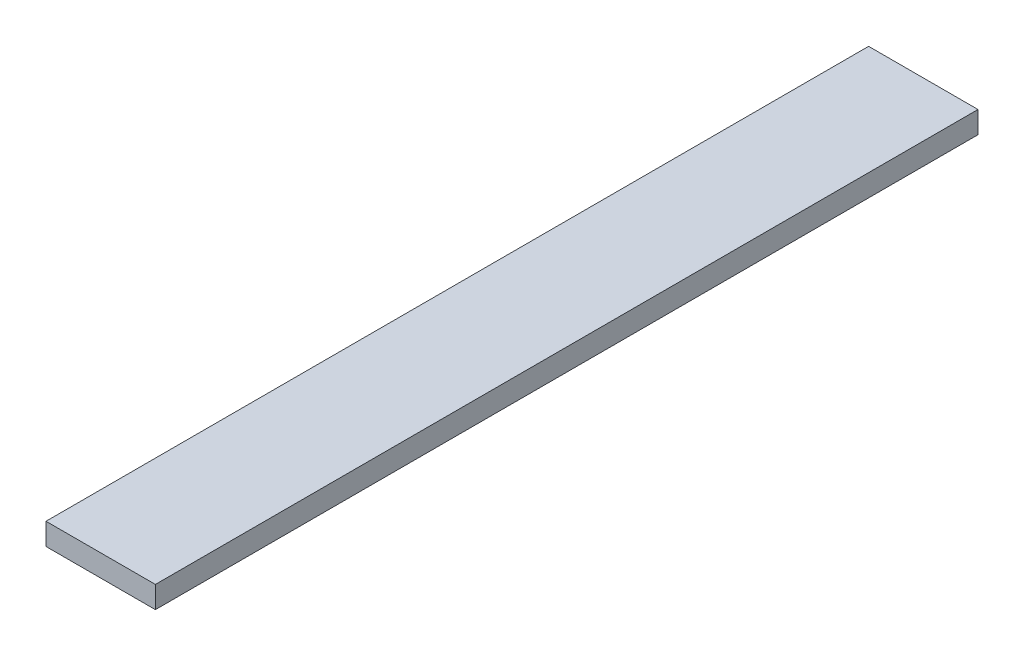
ISO-10303-21;
HEADER;
FILE_DESCRIPTION(('STEP AP214'),'2;1');
FILE_NAME('part.step','',(''),(''),'','','');
FILE_SCHEMA(('AUTOMOTIVE_DESIGN { 1 0 10303 214 1 1 1 1 }'));
ENDSEC;
DATA;
#1=APPLICATION_CONTEXT('core data for automotive mechanical design processes');
#2=APPLICATION_PROTOCOL_DEFINITION('international standard','automotive_design',2000,#1);
#3=PRODUCT_CONTEXT('',#1,'mechanical');
#4=PRODUCT('Part','Part','',(#3));
#5=PRODUCT_RELATED_PRODUCT_CATEGORY('part','',(#4));
#6=PRODUCT_DEFINITION_FORMATION('','',#4);
#7=PRODUCT_DEFINITION_CONTEXT('part definition',#1,'design');
#8=PRODUCT_DEFINITION('design','',#6,#7);
#9=PRODUCT_DEFINITION_SHAPE('','',#8);
#10=(LENGTH_UNIT() NAMED_UNIT(*) SI_UNIT(.MILLI.,.METRE.));
#11=(NAMED_UNIT(*) PLANE_ANGLE_UNIT() SI_UNIT($,.RADIAN.));
#12=(NAMED_UNIT(*) SI_UNIT($,.STERADIAN.) SOLID_ANGLE_UNIT());
#13=UNCERTAINTY_MEASURE_WITH_UNIT(LENGTH_MEASURE(1.E-05),#10,'distance_accuracy_value','');
#14=(GEOMETRIC_REPRESENTATION_CONTEXT(3) GLOBAL_UNCERTAINTY_ASSIGNED_CONTEXT((#13)) GLOBAL_UNIT_ASSIGNED_CONTEXT((#10,
#11,#12)) REPRESENTATION_CONTEXT('',''));
#15=CARTESIAN_POINT('',(0.,0.,0.));
#16=DIRECTION('',(0.,0.,1.));
#17=DIRECTION('',(1.,0.,0.));
#18=AXIS2_PLACEMENT_3D('',#15,#16,#17);
#19=CARTESIAN_POINT('',(0.,1.42999999999,0.));
#20=DIRECTION('',(0.,-1.,0.));
#21=DIRECTION('',(1.,0.,0.));
#22=AXIS2_PLACEMENT_3D('',#19,#20,#21);
#23=PLANE('',#22);
#24=DIRECTION('',(0.,0.,1.));
#25=VECTOR('',#24,1.);
#26=CARTESIAN_POINT('',(1.625,1.42999999999,0.195));
#27=LINE('',#26,#25);
#28=CARTESIAN_POINT('',(1.625,1.42999999999,0.195));
#29=VERTEX_POINT('',#28);
#30=CARTESIAN_POINT('',(1.625,1.42999999999,2.075));
#31=VERTEX_POINT('',#30);
#32=EDGE_CURVE('E80',#29,#31,#27,.T.);
#33=ORIENTED_EDGE('',*,*,#32,.T.);
#34=DIRECTION('',(-1.,0.,0.));
#35=VECTOR('',#34,1.);
#36=CARTESIAN_POINT('',(1.875,1.42999999999,2.075));
#37=LINE('',#36,#35);
#38=CARTESIAN_POINT('',(1.875,1.42999999999,2.075));
#39=VERTEX_POINT('',#38);
#40=EDGE_CURVE('E67',#31,#39,#37,.F.);
#41=ORIENTED_EDGE('',*,*,#40,.T.);
#42=DIRECTION('',(0.,0.,1.));
#43=VECTOR('',#42,1.);
#44=CARTESIAN_POINT('',(1.875,1.42999999999,0.195));
#45=LINE('',#44,#43);
#46=CARTESIAN_POINT('',(1.875,1.42999999999,0.195));
#47=VERTEX_POINT('',#46);
#48=EDGE_CURVE('E54',#39,#47,#45,.F.);
#49=ORIENTED_EDGE('',*,*,#48,.T.);
#50=DIRECTION('',(1.,0.,0.));
#51=VECTOR('',#50,1.);
#52=CARTESIAN_POINT('',(1.875,1.42999999999,0.195));
#53=LINE('',#52,#51);
#54=EDGE_CURVE('E19',#47,#29,#53,.F.);
#55=ORIENTED_EDGE('',*,*,#54,.T.);
#56=EDGE_LOOP('',(#33,#41,#49,#55));
#57=FACE_BOUND('',#56,.T.);
#58=ADVANCED_FACE('F16',(#57),#23,.F.);
#59=CARTESIAN_POINT('',(1.875,1.37999999999,0.195));
#60=DIRECTION('',(0.,0.,1.));
#61=DIRECTION('',(1.,0.,0.));
#62=AXIS2_PLACEMENT_3D('',#59,#60,#61);
#63=PLANE('',#62);
#64=DIRECTION('',(0.,-1.,0.));
#65=VECTOR('',#64,1.);
#66=CARTESIAN_POINT('',(1.875,1.37999999999,0.195));
#67=LINE('',#66,#65);
#68=CARTESIAN_POINT('',(1.875,1.37999999999,0.195));
#69=VERTEX_POINT('',#68);
#70=EDGE_CURVE('E60',#47,#69,#67,.T.);
#71=ORIENTED_EDGE('',*,*,#70,.T.);
#72=DIRECTION('',(1.,0.,0.));
#73=VECTOR('',#72,1.);
#74=CARTESIAN_POINT('',(0.,1.37999999999,0.195));
#75=LINE('',#74,#73);
#76=CARTESIAN_POINT('',(1.625,1.37999999999,0.195));
#77=VERTEX_POINT('',#76);
#78=EDGE_CURVE('E82',#77,#69,#75,.T.);
#79=ORIENTED_EDGE('',*,*,#78,.F.);
#80=DIRECTION('',(0.,1.,0.));
#81=VECTOR('',#80,1.);
#82=CARTESIAN_POINT('',(1.625,1.37999999999,0.195));
#83=LINE('',#82,#81);
#84=EDGE_CURVE('E63',#77,#29,#83,.T.);
#85=ORIENTED_EDGE('',*,*,#84,.T.);
#86=ORIENTED_EDGE('',*,*,#54,.F.);
#87=EDGE_LOOP('',(#71,#79,#85,#86));
#88=FACE_BOUND('',#87,.T.);
#89=ADVANCED_FACE('F59',(#88),#63,.F.);
#90=CARTESIAN_POINT('',(1.875,1.37999999999,0.195));
#91=DIRECTION('',(-1.,0.,0.));
#92=DIRECTION('',(0.,-1.,0.));
#93=AXIS2_PLACEMENT_3D('',#90,#91,#92);
#94=PLANE('',#93);
#95=DIRECTION('',(0.,1.,0.));
#96=VECTOR('',#95,1.);
#97=CARTESIAN_POINT('',(1.875,1.37999999999,2.075));
#98=LINE('',#97,#96);
#99=CARTESIAN_POINT('',(1.875,1.37999999999,2.075));
#100=VERTEX_POINT('',#99);
#101=EDGE_CURVE('E69',#39,#100,#98,.F.);
#102=ORIENTED_EDGE('',*,*,#101,.T.);
#103=DIRECTION('',(0.,0.,1.));
#104=VECTOR('',#103,1.);
#105=CARTESIAN_POINT('',(1.875,1.37999999999,0.));
#106=LINE('',#105,#104);
#107=EDGE_CURVE('E73',#69,#100,#106,.T.);
#108=ORIENTED_EDGE('',*,*,#107,.F.);
#109=ORIENTED_EDGE('',*,*,#70,.F.);
#110=ORIENTED_EDGE('',*,*,#48,.F.);
#111=EDGE_LOOP('',(#102,#108,#109,#110));
#112=FACE_BOUND('',#111,.T.);
#113=ADVANCED_FACE('F71',(#112),#94,.F.);
#114=CARTESIAN_POINT('',(1.875,1.37999999999,2.075));
#115=DIRECTION('',(0.,0.,-1.));
#116=DIRECTION('',(-1.,0.,0.));
#117=AXIS2_PLACEMENT_3D('',#114,#115,#116);
#118=PLANE('',#117);
#119=DIRECTION('',(0.,1.,0.));
#120=VECTOR('',#119,1.);
#121=CARTESIAN_POINT('',(1.625,1.37999999999,2.075));
#122=LINE('',#121,#120);
#123=CARTESIAN_POINT('',(1.625,1.37999999999,2.075));
#124=VERTEX_POINT('',#123);
#125=EDGE_CURVE('E34',#31,#124,#122,.F.);
#126=ORIENTED_EDGE('',*,*,#125,.T.);
#127=DIRECTION('',(1.,0.,0.));
#128=VECTOR('',#127,1.);
#129=CARTESIAN_POINT('',(0.,1.37999999999,2.075));
#130=LINE('',#129,#128);
#131=EDGE_CURVE('E25',#100,#124,#130,.F.);
#132=ORIENTED_EDGE('',*,*,#131,.F.);
#133=ORIENTED_EDGE('',*,*,#101,.F.);
#134=ORIENTED_EDGE('',*,*,#40,.F.);
#135=EDGE_LOOP('',(#126,#132,#133,#134));
#136=FACE_BOUND('',#135,.T.);
#137=ADVANCED_FACE('F88',(#136),#118,.F.);
#138=CARTESIAN_POINT('',(1.625,1.37999999999,0.195));
#139=DIRECTION('',(1.,0.,0.));
#140=DIRECTION('',(0.,1.,0.));
#141=AXIS2_PLACEMENT_3D('',#138,#139,#140);
#142=PLANE('',#141);
#143=ORIENTED_EDGE('',*,*,#84,.F.);
#144=DIRECTION('',(0.,0.,1.));
#145=VECTOR('',#144,1.);
#146=CARTESIAN_POINT('',(1.625,1.37999999999,0.));
#147=LINE('',#146,#145);
#148=EDGE_CURVE('E11',#124,#77,#147,.F.);
#149=ORIENTED_EDGE('',*,*,#148,.F.);
#150=ORIENTED_EDGE('',*,*,#125,.F.);
#151=ORIENTED_EDGE('',*,*,#32,.F.);
#152=EDGE_LOOP('',(#143,#149,#150,#151));
#153=FACE_BOUND('',#152,.T.);
#154=ADVANCED_FACE('F90',(#153),#142,.F.);
#155=CARTESIAN_POINT('',(0.,1.37999999999,0.));
#156=DIRECTION('',(0.,-1.,0.));
#157=DIRECTION('',(1.,0.,0.));
#158=AXIS2_PLACEMENT_3D('',#155,#156,#157);
#159=PLANE('',#158);
#160=ORIENTED_EDGE('',*,*,#131,.T.);
#161=ORIENTED_EDGE('',*,*,#148,.T.);
#162=ORIENTED_EDGE('',*,*,#78,.T.);
#163=ORIENTED_EDGE('',*,*,#107,.T.);
#164=EDGE_LOOP('',(#160,#161,#162,#163));
#165=FACE_BOUND('',#164,.T.);
#166=ADVANCED_FACE('F87',(#165),#159,.T.);
#167=CLOSED_SHELL('',(#58,#89,#113,#137,#154,#166));
#168=MANIFOLD_SOLID_BREP('B1',#167);
#169=ADVANCED_BREP_SHAPE_REPRESENTATION('',(#18,#168),#14);
#170=SHAPE_DEFINITION_REPRESENTATION(#9,#169);
ENDSEC;
END-ISO-10303-21;
